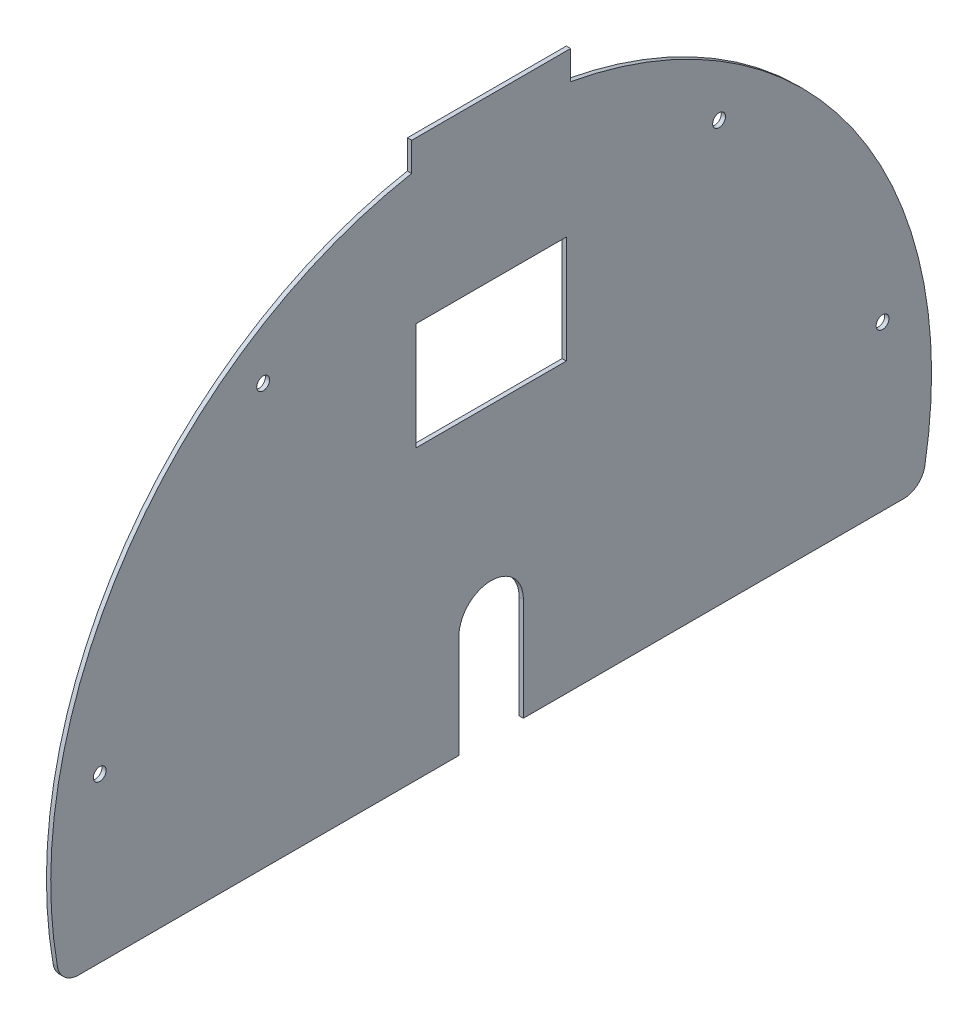
ISO-10303-21;
HEADER;
FILE_DESCRIPTION(('STEP AP214'),'2;1');
FILE_NAME('part.step','',(''),(''),'','','');
FILE_SCHEMA(('AUTOMOTIVE_DESIGN { 1 0 10303 214 1 1 1 1 }'));
ENDSEC;
DATA;
#1=APPLICATION_CONTEXT('core data for automotive mechanical design processes');
#2=APPLICATION_PROTOCOL_DEFINITION('international standard','automotive_design',2000,#1);
#3=PRODUCT_CONTEXT('',#1,'mechanical');
#4=PRODUCT('Part','Part','',(#3));
#5=PRODUCT_RELATED_PRODUCT_CATEGORY('part','',(#4));
#6=PRODUCT_DEFINITION_FORMATION('','',#4);
#7=PRODUCT_DEFINITION_CONTEXT('part definition',#1,'design');
#8=PRODUCT_DEFINITION('design','',#6,#7);
#9=PRODUCT_DEFINITION_SHAPE('','',#8);
#10=(LENGTH_UNIT() NAMED_UNIT(*) SI_UNIT(.MILLI.,.METRE.));
#11=(NAMED_UNIT(*) PLANE_ANGLE_UNIT() SI_UNIT($,.RADIAN.));
#12=(NAMED_UNIT(*) SI_UNIT($,.STERADIAN.) SOLID_ANGLE_UNIT());
#13=UNCERTAINTY_MEASURE_WITH_UNIT(LENGTH_MEASURE(1.E-05),#10,'distance_accuracy_value','');
#14=(GEOMETRIC_REPRESENTATION_CONTEXT(3) GLOBAL_UNCERTAINTY_ASSIGNED_CONTEXT((#13)) GLOBAL_UNIT_ASSIGNED_CONTEXT((#10,
#11,#12)) REPRESENTATION_CONTEXT('',''));
#15=CARTESIAN_POINT('',(0.,0.,0.));
#16=DIRECTION('',(0.,0.,1.));
#17=DIRECTION('',(1.,0.,0.));
#18=AXIS2_PLACEMENT_3D('',#15,#16,#17);
#19=CARTESIAN_POINT('',(-2.,48.,15.));
#20=DIRECTION('',(0.,0.,-1.));
#21=DIRECTION('',(-1.,0.,0.));
#22=AXIS2_PLACEMENT_3D('',#19,#20,#21);
#23=PLANE('',#22);
#24=DIRECTION('',(0.,1.,0.));
#25=VECTOR('',#24,1.);
#26=CARTESIAN_POINT('',(0.,48.,15.));
#27=LINE('',#26,#25);
#28=CARTESIAN_POINT('',(0.,0.,15.));
#29=VERTEX_POINT('',#28);
#30=CARTESIAN_POINT('',(0.,48.,15.));
#31=VERTEX_POINT('',#30);
#32=EDGE_CURVE('E192',#29,#31,#27,.T.);
#33=ORIENTED_EDGE('',*,*,#32,.F.);
#34=DIRECTION('',(1.,0.,0.));
#35=VECTOR('',#34,1.);
#36=CARTESIAN_POINT('',(-2.,0.,15.));
#37=LINE('',#36,#35);
#38=CARTESIAN_POINT('',(-2.,0.,15.));
#39=VERTEX_POINT('',#38);
#40=EDGE_CURVE('E251',#39,#29,#37,.T.);
#41=ORIENTED_EDGE('',*,*,#40,.F.);
#42=DIRECTION('',(0.,1.,0.));
#43=VECTOR('',#42,1.);
#44=CARTESIAN_POINT('',(-2.,48.,15.));
#45=LINE('',#44,#43);
#46=CARTESIAN_POINT('',(-2.,48.,15.));
#47=VERTEX_POINT('',#46);
#48=EDGE_CURVE('E196',#39,#47,#45,.T.);
#49=ORIENTED_EDGE('',*,*,#48,.T.);
#50=DIRECTION('',(1.,0.,0.));
#51=VECTOR('',#50,1.);
#52=CARTESIAN_POINT('',(-2.,48.,15.));
#53=LINE('',#52,#51);
#54=EDGE_CURVE('E224',#47,#31,#53,.T.);
#55=ORIENTED_EDGE('',*,*,#54,.T.);
#56=EDGE_LOOP('',(#33,#41,#49,#55));
#57=FACE_BOUND('',#56,.T.);
#58=ADVANCED_FACE('F36',(#57),#23,.T.);
#59=CARTESIAN_POINT('',(-2.,0.,15.));
#60=DIRECTION('',(0.,-1.,0.));
#61=DIRECTION('',(0.,0.,-1.));
#62=AXIS2_PLACEMENT_3D('',#59,#60,#61);
#63=PLANE('',#62);
#64=DIRECTION('',(0.,0.,-1.));
#65=VECTOR('',#64,1.);
#66=CARTESIAN_POINT('',(0.,0.,15.));
#67=LINE('',#66,#65);
#68=CARTESIAN_POINT('',(0.,0.,192.013020391847));
#69=VERTEX_POINT('',#68);
#70=EDGE_CURVE('E200',#69,#29,#67,.T.);
#71=ORIENTED_EDGE('',*,*,#70,.F.);
#72=DIRECTION('',(1.,0.,0.));
#73=VECTOR('',#72,1.);
#74=CARTESIAN_POINT('',(-2.,0.,192.013020391847));
#75=LINE('',#74,#73);
#76=CARTESIAN_POINT('',(-2.,0.,192.013020391847));
#77=VERTEX_POINT('',#76);
#78=EDGE_CURVE('E275',#69,#77,#75,.F.);
#79=ORIENTED_EDGE('',*,*,#78,.T.);
#80=DIRECTION('',(0.,0.,-1.));
#81=VECTOR('',#80,1.);
#82=CARTESIAN_POINT('',(-2.,0.,15.));
#83=LINE('',#82,#81);
#84=EDGE_CURVE('E222',#77,#39,#83,.T.);
#85=ORIENTED_EDGE('',*,*,#84,.T.);
#86=ORIENTED_EDGE('',*,*,#40,.T.);
#87=EDGE_LOOP('',(#71,#79,#85,#86));
#88=FACE_BOUND('',#87,.T.);
#89=ADVANCED_FACE('F330',(#88),#63,.T.);
#90=CARTESIAN_POINT('',(-2.,44.,0.));
#91=DIRECTION('',(1.,0.,0.));
#92=DIRECTION('',(0.,0.,-1.));
#93=AXIS2_PLACEMENT_3D('',#90,#91,#92);
#94=CYLINDRICAL_SURFACE('',#93,205.);
#95=CARTESIAN_POINT('',(-2.,44.,0.));
#96=DIRECTION('',(1.,0.,0.));
#97=DIRECTION('',(0.,0.,1.));
#98=AXIS2_PLACEMENT_3D('',#95,#96,#97);
#99=CIRCLE('',#98,205.);
#100=CARTESIAN_POINT('',(-2.,245.633330578057,36.9999999999999));
#101=VERTEX_POINT('',#100);
#102=CARTESIAN_POINT('',(-2.,8.25641025641027,201.859841950404));
#103=VERTEX_POINT('',#102);
#104=EDGE_CURVE('E219',#101,#103,#99,.T.);
#105=ORIENTED_EDGE('',*,*,#104,.T.);
#106=DIRECTION('',(1.,0.,0.));
#107=VECTOR('',#106,1.);
#108=CARTESIAN_POINT('',(-2.,8.25641025641026,201.859841950404));
#109=LINE('',#108,#107);
#110=CARTESIAN_POINT('',(0.,8.25641025641027,201.859841950404));
#111=VERTEX_POINT('',#110);
#112=EDGE_CURVE('E254',#103,#111,#109,.T.);
#113=ORIENTED_EDGE('',*,*,#112,.T.);
#114=CARTESIAN_POINT('',(0.,44.,0.));
#115=DIRECTION('',(1.,0.,0.));
#116=DIRECTION('',(0.,0.,1.));
#117=AXIS2_PLACEMENT_3D('',#114,#115,#116);
#118=CIRCLE('',#117,205.);
#119=CARTESIAN_POINT('',(0.,245.633330578057,36.9999999999999));
#120=VERTEX_POINT('',#119);
#121=EDGE_CURVE('E247',#120,#111,#118,.T.);
#122=ORIENTED_EDGE('',*,*,#121,.F.);
#123=DIRECTION('',(1.,0.,0.));
#124=VECTOR('',#123,1.);
#125=CARTESIAN_POINT('',(-2.,245.633330578057,36.9999999999999));
#126=LINE('',#125,#124);
#127=EDGE_CURVE('E255',#101,#120,#126,.T.);
#128=ORIENTED_EDGE('',*,*,#127,.F.);
#129=EDGE_LOOP('',(#105,#113,#122,#128));
#130=FACE_BOUND('',#129,.T.);
#131=ADVANCED_FACE('F309',(#130),#94,.T.);
#132=CARTESIAN_POINT('',(-2.,245.633330578057,37.));
#133=DIRECTION('',(0.,0.,1.));
#134=DIRECTION('',(1.,0.,0.));
#135=AXIS2_PLACEMENT_3D('',#132,#133,#134);
#136=PLANE('',#135);
#137=DIRECTION('',(0.,-1.,0.));
#138=VECTOR('',#137,1.);
#139=CARTESIAN_POINT('',(0.,245.633330578057,37.));
#140=LINE('',#139,#138);
#141=CARTESIAN_POINT('',(0.,259.,37.));
#142=VERTEX_POINT('',#141);
#143=EDGE_CURVE('E244',#142,#120,#140,.T.);
#144=ORIENTED_EDGE('',*,*,#143,.F.);
#145=DIRECTION('',(1.,0.,0.));
#146=VECTOR('',#145,1.);
#147=CARTESIAN_POINT('',(-2.,259.,37.));
#148=LINE('',#147,#146);
#149=CARTESIAN_POINT('',(-2.,259.,37.));
#150=VERTEX_POINT('',#149);
#151=EDGE_CURVE('E257',#150,#142,#148,.T.);
#152=ORIENTED_EDGE('',*,*,#151,.F.);
#153=DIRECTION('',(0.,-1.,0.));
#154=VECTOR('',#153,1.);
#155=CARTESIAN_POINT('',(-2.,245.633330578057,37.));
#156=LINE('',#155,#154);
#157=EDGE_CURVE('E216',#150,#101,#156,.T.);
#158=ORIENTED_EDGE('',*,*,#157,.T.);
#159=ORIENTED_EDGE('',*,*,#127,.T.);
#160=EDGE_LOOP('',(#144,#152,#158,#159));
#161=FACE_BOUND('',#160,.T.);
#162=ADVANCED_FACE('F314',(#161),#136,.T.);
#163=CARTESIAN_POINT('',(-2.,259.,37.));
#164=DIRECTION('',(0.,1.,0.));
#165=DIRECTION('',(0.,0.,1.));
#166=AXIS2_PLACEMENT_3D('',#163,#164,#165);
#167=PLANE('',#166);
#168=DIRECTION('',(0.,0.,1.));
#169=VECTOR('',#168,1.);
#170=CARTESIAN_POINT('',(0.,259.,37.));
#171=LINE('',#170,#169);
#172=CARTESIAN_POINT('',(0.,259.,-37.));
#173=VERTEX_POINT('',#172);
#174=EDGE_CURVE('E241',#173,#142,#171,.T.);
#175=ORIENTED_EDGE('',*,*,#174,.F.);
#176=DIRECTION('',(1.,0.,0.));
#177=VECTOR('',#176,1.);
#178=CARTESIAN_POINT('',(-2.,259.,-37.));
#179=LINE('',#178,#177);
#180=CARTESIAN_POINT('',(-2.,259.,-37.));
#181=VERTEX_POINT('',#180);
#182=EDGE_CURVE('E259',#181,#173,#179,.T.);
#183=ORIENTED_EDGE('',*,*,#182,.F.);
#184=DIRECTION('',(0.,0.,1.));
#185=VECTOR('',#184,1.);
#186=CARTESIAN_POINT('',(-2.,259.,37.));
#187=LINE('',#186,#185);
#188=EDGE_CURVE('E213',#181,#150,#187,.T.);
#189=ORIENTED_EDGE('',*,*,#188,.T.);
#190=ORIENTED_EDGE('',*,*,#151,.T.);
#191=EDGE_LOOP('',(#175,#183,#189,#190));
#192=FACE_BOUND('',#191,.T.);
#193=ADVANCED_FACE('F319',(#192),#167,.T.);
#194=CARTESIAN_POINT('',(-2.,259.,-37.));
#195=DIRECTION('',(0.,0.,-1.));
#196=DIRECTION('',(-1.,0.,0.));
#197=AXIS2_PLACEMENT_3D('',#194,#195,#196);
#198=PLANE('',#197);
#199=DIRECTION('',(0.,1.,0.));
#200=VECTOR('',#199,1.);
#201=CARTESIAN_POINT('',(0.,259.,-37.));
#202=LINE('',#201,#200);
#203=CARTESIAN_POINT('',(0.,245.633330578057,-37.));
#204=VERTEX_POINT('',#203);
#205=EDGE_CURVE('E238',#204,#173,#202,.T.);
#206=ORIENTED_EDGE('',*,*,#205,.F.);
#207=DIRECTION('',(1.,0.,0.));
#208=VECTOR('',#207,1.);
#209=CARTESIAN_POINT('',(-2.,245.633330578057,-37.));
#210=LINE('',#209,#208);
#211=CARTESIAN_POINT('',(-2.,245.633330578057,-37.));
#212=VERTEX_POINT('',#211);
#213=EDGE_CURVE('E261',#212,#204,#210,.T.);
#214=ORIENTED_EDGE('',*,*,#213,.F.);
#215=DIRECTION('',(0.,1.,0.));
#216=VECTOR('',#215,1.);
#217=CARTESIAN_POINT('',(-2.,259.,-37.));
#218=LINE('',#217,#216);
#219=EDGE_CURVE('E210',#212,#181,#218,.T.);
#220=ORIENTED_EDGE('',*,*,#219,.T.);
#221=ORIENTED_EDGE('',*,*,#182,.T.);
#222=EDGE_LOOP('',(#206,#214,#220,#221));
#223=FACE_BOUND('',#222,.T.);
#224=ADVANCED_FACE('F322',(#223),#198,.T.);
#225=CARTESIAN_POINT('',(-2.,44.,0.));
#226=DIRECTION('',(1.,0.,0.));
#227=DIRECTION('',(0.,0.,-1.));
#228=AXIS2_PLACEMENT_3D('',#225,#226,#227);
#229=CYLINDRICAL_SURFACE('',#228,205.);
#230=CARTESIAN_POINT('',(0.,44.,0.));
#231=DIRECTION('',(1.,0.,0.));
#232=DIRECTION('',(0.,0.,1.));
#233=AXIS2_PLACEMENT_3D('',#230,#231,#232);
#234=CIRCLE('',#233,205.);
#235=CARTESIAN_POINT('',(0.,8.25641025641025,-201.859841950404));
#236=VERTEX_POINT('',#235);
#237=EDGE_CURVE('E236',#236,#204,#234,.T.);
#238=ORIENTED_EDGE('',*,*,#237,.F.);
#239=DIRECTION('',(1.,0.,0.));
#240=VECTOR('',#239,1.);
#241=CARTESIAN_POINT('',(-2.,8.25641025641024,-201.859841950404));
#242=LINE('',#241,#240);
#243=CARTESIAN_POINT('',(-2.,8.25641025641025,-201.859841950404));
#244=VERTEX_POINT('',#243);
#245=EDGE_CURVE('E11',#236,#244,#242,.F.);
#246=ORIENTED_EDGE('',*,*,#245,.T.);
#247=CARTESIAN_POINT('',(-2.,44.,0.));
#248=DIRECTION('',(1.,0.,0.));
#249=DIRECTION('',(0.,0.,1.));
#250=AXIS2_PLACEMENT_3D('',#247,#248,#249);
#251=CIRCLE('',#250,205.);
#252=EDGE_CURVE('E208',#244,#212,#251,.T.);
#253=ORIENTED_EDGE('',*,*,#252,.T.);
#254=ORIENTED_EDGE('',*,*,#213,.T.);
#255=EDGE_LOOP('',(#238,#246,#253,#254));
#256=FACE_BOUND('',#255,.T.);
#257=ADVANCED_FACE('F343',(#256),#229,.T.);
#258=CARTESIAN_POINT('',(-2.,0.,-15.));
#259=DIRECTION('',(0.,-1.,0.));
#260=DIRECTION('',(0.,0.,-1.));
#261=AXIS2_PLACEMENT_3D('',#258,#259,#260);
#262=PLANE('',#261);
#263=DIRECTION('',(0.,0.,-1.));
#264=VECTOR('',#263,1.);
#265=CARTESIAN_POINT('',(-2.,0.,-15.));
#266=LINE('',#265,#264);
#267=CARTESIAN_POINT('',(-2.,0.,-15.));
#268=VERTEX_POINT('',#267);
#269=CARTESIAN_POINT('',(-2.,0.,-192.013020391847));
#270=VERTEX_POINT('',#269);
#271=EDGE_CURVE('E206',#268,#270,#266,.T.);
#272=ORIENTED_EDGE('',*,*,#271,.T.);
#273=DIRECTION('',(1.,0.,0.));
#274=VECTOR('',#273,1.);
#275=CARTESIAN_POINT('',(-2.,0.,-192.013020391847));
#276=LINE('',#275,#274);
#277=CARTESIAN_POINT('',(0.,0.,-192.013020391847));
#278=VERTEX_POINT('',#277);
#279=EDGE_CURVE('E44',#270,#278,#276,.T.);
#280=ORIENTED_EDGE('',*,*,#279,.T.);
#281=DIRECTION('',(0.,0.,-1.));
#282=VECTOR('',#281,1.);
#283=CARTESIAN_POINT('',(0.,0.,-15.));
#284=LINE('',#283,#282);
#285=CARTESIAN_POINT('',(0.,0.,-15.));
#286=VERTEX_POINT('',#285);
#287=EDGE_CURVE('E233',#286,#278,#284,.T.);
#288=ORIENTED_EDGE('',*,*,#287,.F.);
#289=DIRECTION('',(1.,0.,0.));
#290=VECTOR('',#289,1.);
#291=CARTESIAN_POINT('',(-2.,0.,-15.));
#292=LINE('',#291,#290);
#293=EDGE_CURVE('E264',#268,#286,#292,.T.);
#294=ORIENTED_EDGE('',*,*,#293,.F.);
#295=EDGE_LOOP('',(#272,#280,#288,#294));
#296=FACE_BOUND('',#295,.T.);
#297=ADVANCED_FACE('F283',(#296),#262,.T.);
#298=CARTESIAN_POINT('',(-2.,48.,-15.));
#299=DIRECTION('',(0.,0.,1.));
#300=DIRECTION('',(0.,-1.,0.));
#301=AXIS2_PLACEMENT_3D('',#298,#299,#300);
#302=PLANE('',#301);
#303=DIRECTION('',(0.,-1.,0.));
#304=VECTOR('',#303,1.);
#305=CARTESIAN_POINT('',(0.,48.,-15.));
#306=LINE('',#305,#304);
#307=CARTESIAN_POINT('',(0.,48.,-15.));
#308=VERTEX_POINT('',#307);
#309=EDGE_CURVE('E230',#308,#286,#306,.T.);
#310=ORIENTED_EDGE('',*,*,#309,.F.);
#311=DIRECTION('',(1.,0.,0.));
#312=VECTOR('',#311,1.);
#313=CARTESIAN_POINT('',(-2.,48.,-15.));
#314=LINE('',#313,#312);
#315=CARTESIAN_POINT('',(-2.,48.,-15.));
#316=VERTEX_POINT('',#315);
#317=EDGE_CURVE('E266',#316,#308,#314,.T.);
#318=ORIENTED_EDGE('',*,*,#317,.F.);
#319=DIRECTION('',(0.,-1.,0.));
#320=VECTOR('',#319,1.);
#321=CARTESIAN_POINT('',(-2.,48.,-15.));
#322=LINE('',#321,#320);
#323=EDGE_CURVE('E203',#316,#268,#322,.T.);
#324=ORIENTED_EDGE('',*,*,#323,.T.);
#325=ORIENTED_EDGE('',*,*,#293,.T.);
#326=EDGE_LOOP('',(#310,#318,#324,#325));
#327=FACE_BOUND('',#326,.T.);
#328=ADVANCED_FACE('F290',(#327),#302,.T.);
#329=CARTESIAN_POINT('',(-2.,48.,0.));
#330=DIRECTION('',(1.,0.,0.));
#331=DIRECTION('',(0.,0.,-1.));
#332=AXIS2_PLACEMENT_3D('',#329,#330,#331);
#333=CYLINDRICAL_SURFACE('',#332,15.);
#334=CARTESIAN_POINT('',(0.,48.,0.));
#335=DIRECTION('',(-1.,0.,0.));
#336=DIRECTION('',(0.,0.,1.));
#337=AXIS2_PLACEMENT_3D('',#334,#335,#336);
#338=CIRCLE('',#337,15.);
#339=EDGE_CURVE('E227',#31,#308,#338,.T.);
#340=ORIENTED_EDGE('',*,*,#339,.F.);
#341=ORIENTED_EDGE('',*,*,#54,.F.);
#342=CARTESIAN_POINT('',(-2.,48.,0.));
#343=DIRECTION('',(-1.,0.,0.));
#344=DIRECTION('',(0.,0.,1.));
#345=AXIS2_PLACEMENT_3D('',#342,#343,#344);
#346=CIRCLE('',#345,15.);
#347=EDGE_CURVE('E199',#47,#316,#346,.T.);
#348=ORIENTED_EDGE('',*,*,#347,.T.);
#349=ORIENTED_EDGE('',*,*,#317,.T.);
#350=EDGE_LOOP('',(#340,#341,#348,#349));
#351=FACE_BOUND('',#350,.T.);
#352=ADVANCED_FACE('F296',(#351),#333,.F.);
#353=CARTESIAN_POINT('',(-2.,44.,0.));
#354=DIRECTION('',(-1.,0.,0.));
#355=DIRECTION('',(0.,0.,1.));
#356=AXIS2_PLACEMENT_3D('',#353,#354,#355);
#357=PLANE('',#356);
#358=CARTESIAN_POINT('',(-2.,76.1249128683809,-182.189434307259));
#359=DIRECTION('',(-1.,0.,0.));
#360=DIRECTION('',(0.,0.,1.));
#361=AXIS2_PLACEMENT_3D('',#358,#359,#360);
#362=CIRCLE('',#361,2.99999999999999);
#363=CARTESIAN_POINT('',(-2.,76.1249128683809,-179.189434307259));
#364=VERTEX_POINT('',#363);
#365=EDGE_CURVE('E391',#364,#364,#362,.T.);
#366=ORIENTED_EDGE('',*,*,#365,.F.);
#367=EDGE_LOOP('',(#366));
#368=FACE_BOUND('',#367,.T.);
#369=CARTESIAN_POINT('',(-2.,195.543128193463,-106.111640724944));
#370=DIRECTION('',(-1.,0.,0.));
#371=DIRECTION('',(0.,0.,1.));
#372=AXIS2_PLACEMENT_3D('',#369,#370,#371);
#373=CIRCLE('',#372,3.00000000000001);
#374=CARTESIAN_POINT('',(-2.,195.543128193463,-103.111640724944));
#375=VERTEX_POINT('',#374);
#376=EDGE_CURVE('E395',#375,#375,#373,.T.);
#377=ORIENTED_EDGE('',*,*,#376,.F.);
#378=EDGE_LOOP('',(#377));
#379=FACE_BOUND('',#378,.T.);
#380=CARTESIAN_POINT('',(-2.,76.1249128683809,182.189434307259));
#381=DIRECTION('',(-1.,0.,0.));
#382=DIRECTION('',(0.,0.,1.));
#383=AXIS2_PLACEMENT_3D('',#380,#381,#382);
#384=CIRCLE('',#383,2.99999999999999);
#385=CARTESIAN_POINT('',(-2.,76.1249128683809,185.189434307259));
#386=VERTEX_POINT('',#385);
#387=EDGE_CURVE('E406',#386,#386,#384,.F.);
#388=ORIENTED_EDGE('',*,*,#387,.T.);
#389=EDGE_LOOP('',(#388));
#390=FACE_BOUND('',#389,.T.);
#391=CARTESIAN_POINT('',(-2.,195.543128193463,106.111640724944));
#392=DIRECTION('',(-1.,0.,0.));
#393=DIRECTION('',(0.,0.,1.));
#394=AXIS2_PLACEMENT_3D('',#391,#392,#393);
#395=CIRCLE('',#394,3.00000000000001);
#396=CARTESIAN_POINT('',(-2.,195.543128193463,109.111640724944));
#397=VERTEX_POINT('',#396);
#398=EDGE_CURVE('E179',#397,#397,#395,.F.);
#399=ORIENTED_EDGE('',*,*,#398,.T.);
#400=EDGE_LOOP('',(#399));
#401=FACE_BOUND('',#400,.T.);
#402=DIRECTION('',(0.,1.,0.));
#403=VECTOR('',#402,1.);
#404=CARTESIAN_POINT('',(-2.,134.,-35.));
#405=LINE('',#404,#403);
#406=CARTESIAN_POINT('',(-2.,134.,-35.));
#407=VERTEX_POINT('',#406);
#408=CARTESIAN_POINT('',(-2.,184.,-35.));
#409=VERTEX_POINT('',#408);
#410=EDGE_CURVE('E153',#407,#409,#405,.T.);
#411=ORIENTED_EDGE('',*,*,#410,.T.);
#412=DIRECTION('',(0.,0.,1.));
#413=VECTOR('',#412,1.);
#414=CARTESIAN_POINT('',(-2.,184.,35.));
#415=LINE('',#414,#413);
#416=CARTESIAN_POINT('',(-2.,184.,35.));
#417=VERTEX_POINT('',#416);
#418=EDGE_CURVE('E165',#409,#417,#415,.T.);
#419=ORIENTED_EDGE('',*,*,#418,.T.);
#420=DIRECTION('',(0.,-1.,0.));
#421=VECTOR('',#420,1.);
#422=CARTESIAN_POINT('',(-2.,134.,35.));
#423=LINE('',#422,#421);
#424=CARTESIAN_POINT('',(-2.,134.,35.));
#425=VERTEX_POINT('',#424);
#426=EDGE_CURVE('E169',#417,#425,#423,.T.);
#427=ORIENTED_EDGE('',*,*,#426,.T.);
#428=DIRECTION('',(0.,0.,-1.));
#429=VECTOR('',#428,1.);
#430=CARTESIAN_POINT('',(-2.,134.,35.));
#431=LINE('',#430,#429);
#432=EDGE_CURVE('E161',#425,#407,#431,.T.);
#433=ORIENTED_EDGE('',*,*,#432,.T.);
#434=EDGE_LOOP('',(#411,#419,#427,#433));
#435=FACE_BOUND('',#434,.T.);
#436=ORIENTED_EDGE('',*,*,#84,.F.);
#437=CARTESIAN_POINT('',(-2.,10.,192.013020391847));
#438=DIRECTION('',(-1.,0.,0.));
#439=DIRECTION('',(0.,0.,1.));
#440=AXIS2_PLACEMENT_3D('',#437,#438,#439);
#441=CIRCLE('',#440,10.);
#442=EDGE_CURVE('E278',#77,#103,#441,.T.);
#443=ORIENTED_EDGE('',*,*,#442,.T.);
#444=ORIENTED_EDGE('',*,*,#104,.F.);
#445=ORIENTED_EDGE('',*,*,#157,.F.);
#446=ORIENTED_EDGE('',*,*,#188,.F.);
#447=ORIENTED_EDGE('',*,*,#219,.F.);
#448=ORIENTED_EDGE('',*,*,#252,.F.);
#449=CARTESIAN_POINT('',(-2.,10.,-192.013020391847));
#450=DIRECTION('',(-1.,0.,0.));
#451=DIRECTION('',(0.,0.,1.));
#452=AXIS2_PLACEMENT_3D('',#449,#450,#451);
#453=CIRCLE('',#452,10.);
#454=EDGE_CURVE('E51',#244,#270,#453,.T.);
#455=ORIENTED_EDGE('',*,*,#454,.T.);
#456=ORIENTED_EDGE('',*,*,#271,.F.);
#457=ORIENTED_EDGE('',*,*,#323,.F.);
#458=ORIENTED_EDGE('',*,*,#347,.F.);
#459=ORIENTED_EDGE('',*,*,#48,.F.);
#460=EDGE_LOOP('',(#436,#443,#444,#445,#446,#447,#448,#455,#456,#457,#458,#459));
#461=FACE_BOUND('',#460,.T.);
#462=ADVANCED_FACE('F171',(#368,#379,#390,#401,#435,#461),#357,.T.);
#463=CARTESIAN_POINT('',(0.,44.,0.));
#464=DIRECTION('',(-1.,0.,0.));
#465=DIRECTION('',(0.,0.,1.));
#466=AXIS2_PLACEMENT_3D('',#463,#464,#465);
#467=PLANE('',#466);
#468=CARTESIAN_POINT('',(0.,76.1249128683809,-182.189434307259));
#469=DIRECTION('',(-1.,0.,0.));
#470=DIRECTION('',(0.,0.,1.));
#471=AXIS2_PLACEMENT_3D('',#468,#469,#470);
#472=CIRCLE('',#471,2.99999999999999);
#473=CARTESIAN_POINT('',(0.,76.1249128683809,-179.189434307259));
#474=VERTEX_POINT('',#473);
#475=EDGE_CURVE('E394',#474,#474,#472,.T.);
#476=ORIENTED_EDGE('',*,*,#475,.T.);
#477=EDGE_LOOP('',(#476));
#478=FACE_BOUND('',#477,.T.);
#479=CARTESIAN_POINT('',(0.,195.543128193463,-106.111640724944));
#480=DIRECTION('',(-1.,0.,0.));
#481=DIRECTION('',(0.,0.,1.));
#482=AXIS2_PLACEMENT_3D('',#479,#480,#481);
#483=CIRCLE('',#482,3.00000000000001);
#484=CARTESIAN_POINT('',(0.,195.543128193463,-103.111640724944));
#485=VERTEX_POINT('',#484);
#486=EDGE_CURVE('E399',#485,#485,#483,.T.);
#487=ORIENTED_EDGE('',*,*,#486,.T.);
#488=EDGE_LOOP('',(#487));
#489=FACE_BOUND('',#488,.T.);
#490=CARTESIAN_POINT('',(0.,76.1249128683809,182.189434307259));
#491=DIRECTION('',(1.,0.,0.));
#492=DIRECTION('',(0.,0.,-1.));
#493=AXIS2_PLACEMENT_3D('',#490,#491,#492);
#494=CIRCLE('',#493,2.99999999999999);
#495=CARTESIAN_POINT('',(0.,76.1249128683809,179.189434307259));
#496=VERTEX_POINT('',#495);
#497=EDGE_CURVE('E186',#496,#496,#494,.T.);
#498=ORIENTED_EDGE('',*,*,#497,.F.);
#499=EDGE_LOOP('',(#498));
#500=FACE_BOUND('',#499,.T.);
#501=CARTESIAN_POINT('',(0.,195.543128193463,106.111640724944));
#502=DIRECTION('',(1.,0.,0.));
#503=DIRECTION('',(0.,0.,-1.));
#504=AXIS2_PLACEMENT_3D('',#501,#502,#503);
#505=CIRCLE('',#504,3.00000000000001);
#506=CARTESIAN_POINT('',(0.,195.543128193463,103.111640724944));
#507=VERTEX_POINT('',#506);
#508=EDGE_CURVE('E408',#507,#507,#505,.T.);
#509=ORIENTED_EDGE('',*,*,#508,.F.);
#510=EDGE_LOOP('',(#509));
#511=FACE_BOUND('',#510,.T.);
#512=DIRECTION('',(0.,0.,1.));
#513=VECTOR('',#512,1.);
#514=CARTESIAN_POINT('',(0.,184.,35.));
#515=LINE('',#514,#513);
#516=CARTESIAN_POINT('',(0.,184.,-35.));
#517=VERTEX_POINT('',#516);
#518=CARTESIAN_POINT('',(0.,184.,35.));
#519=VERTEX_POINT('',#518);
#520=EDGE_CURVE('E185',#517,#519,#515,.T.);
#521=ORIENTED_EDGE('',*,*,#520,.F.);
#522=DIRECTION('',(0.,1.,0.));
#523=VECTOR('',#522,1.);
#524=CARTESIAN_POINT('',(0.,134.,-35.));
#525=LINE('',#524,#523);
#526=CARTESIAN_POINT('',(0.,134.,-35.));
#527=VERTEX_POINT('',#526);
#528=EDGE_CURVE('E156',#527,#517,#525,.T.);
#529=ORIENTED_EDGE('',*,*,#528,.F.);
#530=DIRECTION('',(0.,0.,-1.));
#531=VECTOR('',#530,1.);
#532=CARTESIAN_POINT('',(0.,134.,35.));
#533=LINE('',#532,#531);
#534=CARTESIAN_POINT('',(0.,134.,35.));
#535=VERTEX_POINT('',#534);
#536=EDGE_CURVE('E173',#535,#527,#533,.T.);
#537=ORIENTED_EDGE('',*,*,#536,.F.);
#538=DIRECTION('',(0.,-1.,0.));
#539=VECTOR('',#538,1.);
#540=CARTESIAN_POINT('',(0.,134.,35.));
#541=LINE('',#540,#539);
#542=EDGE_CURVE('E176',#519,#535,#541,.T.);
#543=ORIENTED_EDGE('',*,*,#542,.F.);
#544=EDGE_LOOP('',(#521,#529,#537,#543));
#545=FACE_BOUND('',#544,.T.);
#546=ORIENTED_EDGE('',*,*,#121,.T.);
#547=CARTESIAN_POINT('',(0.,10.,192.013020391847));
#548=DIRECTION('',(-1.,0.,0.));
#549=DIRECTION('',(0.,0.,1.));
#550=AXIS2_PLACEMENT_3D('',#547,#548,#549);
#551=CIRCLE('',#550,10.);
#552=EDGE_CURVE('E273',#111,#69,#551,.F.);
#553=ORIENTED_EDGE('',*,*,#552,.T.);
#554=ORIENTED_EDGE('',*,*,#70,.T.);
#555=ORIENTED_EDGE('',*,*,#32,.T.);
#556=ORIENTED_EDGE('',*,*,#339,.T.);
#557=ORIENTED_EDGE('',*,*,#309,.T.);
#558=ORIENTED_EDGE('',*,*,#287,.T.);
#559=CARTESIAN_POINT('',(0.,10.,-192.013020391847));
#560=DIRECTION('',(-1.,0.,0.));
#561=DIRECTION('',(0.,0.,1.));
#562=AXIS2_PLACEMENT_3D('',#559,#560,#561);
#563=CIRCLE('',#562,10.);
#564=EDGE_CURVE('E271',#278,#236,#563,.F.);
#565=ORIENTED_EDGE('',*,*,#564,.T.);
#566=ORIENTED_EDGE('',*,*,#237,.T.);
#567=ORIENTED_EDGE('',*,*,#205,.T.);
#568=ORIENTED_EDGE('',*,*,#174,.T.);
#569=ORIENTED_EDGE('',*,*,#143,.T.);
#570=EDGE_LOOP('',(#546,#553,#554,#555,#556,#557,#558,#565,#566,#567,#568,#569));
#571=FACE_BOUND('',#570,.T.);
#572=ADVANCED_FACE('F286',(#478,#489,#500,#511,#545,#571),#467,.F.);
#573=CARTESIAN_POINT('',(-2.,134.,-35.));
#574=DIRECTION('',(0.,0.,-1.));
#575=DIRECTION('',(-1.,0.,0.));
#576=AXIS2_PLACEMENT_3D('',#573,#574,#575);
#577=PLANE('',#576);
#578=ORIENTED_EDGE('',*,*,#528,.T.);
#579=DIRECTION('',(1.,0.,0.));
#580=VECTOR('',#579,1.);
#581=CARTESIAN_POINT('',(-2.,184.,-35.));
#582=LINE('',#581,#580);
#583=EDGE_CURVE('E149',#409,#517,#582,.T.);
#584=ORIENTED_EDGE('',*,*,#583,.F.);
#585=ORIENTED_EDGE('',*,*,#410,.F.);
#586=DIRECTION('',(1.,0.,0.));
#587=VECTOR('',#586,1.);
#588=CARTESIAN_POINT('',(-2.,134.,-35.));
#589=LINE('',#588,#587);
#590=EDGE_CURVE('E190',#407,#527,#589,.T.);
#591=ORIENTED_EDGE('',*,*,#590,.T.);
#592=EDGE_LOOP('',(#578,#584,#585,#591));
#593=FACE_BOUND('',#592,.T.);
#594=ADVANCED_FACE('F151',(#593),#577,.F.);
#595=CARTESIAN_POINT('',(-2.,134.,35.));
#596=DIRECTION('',(0.,-1.,0.));
#597=DIRECTION('',(0.,0.,-1.));
#598=AXIS2_PLACEMENT_3D('',#595,#596,#597);
#599=PLANE('',#598);
#600=ORIENTED_EDGE('',*,*,#536,.T.);
#601=ORIENTED_EDGE('',*,*,#590,.F.);
#602=ORIENTED_EDGE('',*,*,#432,.F.);
#603=DIRECTION('',(1.,0.,0.));
#604=VECTOR('',#603,1.);
#605=CARTESIAN_POINT('',(-2.,134.,35.));
#606=LINE('',#605,#604);
#607=EDGE_CURVE('E193',#425,#535,#606,.T.);
#608=ORIENTED_EDGE('',*,*,#607,.T.);
#609=EDGE_LOOP('',(#600,#601,#602,#608));
#610=FACE_BOUND('',#609,.T.);
#611=ADVANCED_FACE('F362',(#610),#599,.F.);
#612=CARTESIAN_POINT('',(-2.,134.,35.));
#613=DIRECTION('',(0.,0.,1.));
#614=DIRECTION('',(1.,0.,0.));
#615=AXIS2_PLACEMENT_3D('',#612,#613,#614);
#616=PLANE('',#615);
#617=ORIENTED_EDGE('',*,*,#542,.T.);
#618=ORIENTED_EDGE('',*,*,#607,.F.);
#619=ORIENTED_EDGE('',*,*,#426,.F.);
#620=DIRECTION('',(1.,0.,0.));
#621=VECTOR('',#620,1.);
#622=CARTESIAN_POINT('',(-2.,184.,35.));
#623=LINE('',#622,#621);
#624=EDGE_CURVE('E160',#417,#519,#623,.T.);
#625=ORIENTED_EDGE('',*,*,#624,.T.);
#626=EDGE_LOOP('',(#617,#618,#619,#625));
#627=FACE_BOUND('',#626,.T.);
#628=ADVANCED_FACE('F366',(#627),#616,.F.);
#629=CARTESIAN_POINT('',(-2.,184.,35.));
#630=DIRECTION('',(0.,1.,0.));
#631=DIRECTION('',(0.,0.,1.));
#632=AXIS2_PLACEMENT_3D('',#629,#630,#631);
#633=PLANE('',#632);
#634=ORIENTED_EDGE('',*,*,#520,.T.);
#635=ORIENTED_EDGE('',*,*,#624,.F.);
#636=ORIENTED_EDGE('',*,*,#418,.F.);
#637=ORIENTED_EDGE('',*,*,#583,.T.);
#638=EDGE_LOOP('',(#634,#635,#636,#637));
#639=FACE_BOUND('',#638,.T.);
#640=ADVANCED_FACE('F166',(#639),#633,.F.);
#641=CARTESIAN_POINT('',(-2.001,195.543128193463,106.111640724944));
#642=DIRECTION('',(1.,0.,0.));
#643=DIRECTION('',(0.,0.,-1.));
#644=AXIS2_PLACEMENT_3D('',#641,#642,#643);
#645=CYLINDRICAL_SURFACE('',#644,3.00000000000001);
#646=ORIENTED_EDGE('',*,*,#398,.F.);
#647=EDGE_LOOP('',(#646));
#648=FACE_BOUND('',#647,.T.);
#649=ORIENTED_EDGE('',*,*,#508,.T.);
#650=EDGE_LOOP('',(#649));
#651=FACE_BOUND('',#650,.T.);
#652=ADVANCED_FACE('F365',(#648,#651),#645,.F.);
#653=CARTESIAN_POINT('',(-2.001,76.1249128683809,182.189434307259));
#654=DIRECTION('',(1.,0.,0.));
#655=DIRECTION('',(0.,0.,-1.));
#656=AXIS2_PLACEMENT_3D('',#653,#654,#655);
#657=CYLINDRICAL_SURFACE('',#656,2.99999999999999);
#658=ORIENTED_EDGE('',*,*,#387,.F.);
#659=EDGE_LOOP('',(#658));
#660=FACE_BOUND('',#659,.T.);
#661=ORIENTED_EDGE('',*,*,#497,.T.);
#662=EDGE_LOOP('',(#661));
#663=FACE_BOUND('',#662,.T.);
#664=ADVANCED_FACE('F375',(#660,#663),#657,.F.);
#665=CARTESIAN_POINT('',(-2.001,195.543128193463,-106.111640724944));
#666=DIRECTION('',(1.,0.,0.));
#667=DIRECTION('',(0.,0.,-1.));
#668=AXIS2_PLACEMENT_3D('',#665,#666,#667);
#669=CYLINDRICAL_SURFACE('',#668,3.00000000000001);
#670=ORIENTED_EDGE('',*,*,#376,.T.);
#671=EDGE_LOOP('',(#670));
#672=FACE_BOUND('',#671,.T.);
#673=ORIENTED_EDGE('',*,*,#486,.F.);
#674=EDGE_LOOP('',(#673));
#675=FACE_BOUND('',#674,.T.);
#676=ADVANCED_FACE('F379',(#672,#675),#669,.F.);
#677=CARTESIAN_POINT('',(-2.001,76.1249128683809,-182.189434307259));
#678=DIRECTION('',(1.,0.,0.));
#679=DIRECTION('',(0.,0.,-1.));
#680=AXIS2_PLACEMENT_3D('',#677,#678,#679);
#681=CYLINDRICAL_SURFACE('',#680,2.99999999999999);
#682=ORIENTED_EDGE('',*,*,#365,.T.);
#683=EDGE_LOOP('',(#682));
#684=FACE_BOUND('',#683,.T.);
#685=ORIENTED_EDGE('',*,*,#475,.F.);
#686=EDGE_LOOP('',(#685));
#687=FACE_BOUND('',#686,.T.);
#688=ADVANCED_FACE('F328',(#684,#687),#681,.F.);
#689=CARTESIAN_POINT('',(-2.,10.,192.013020391847));
#690=DIRECTION('',(1.,0.,0.));
#691=DIRECTION('',(0.,0.,-1.));
#692=AXIS2_PLACEMENT_3D('',#689,#690,#691);
#693=CYLINDRICAL_SURFACE('',#692,10.);
#694=ORIENTED_EDGE('',*,*,#442,.F.);
#695=ORIENTED_EDGE('',*,*,#78,.F.);
#696=ORIENTED_EDGE('',*,*,#552,.F.);
#697=ORIENTED_EDGE('',*,*,#112,.F.);
#698=EDGE_LOOP('',(#694,#695,#696,#697));
#699=FACE_BOUND('',#698,.T.);
#700=ADVANCED_FACE('F306',(#699),#693,.T.);
#701=CARTESIAN_POINT('',(-2.,10.,-192.013020391847));
#702=DIRECTION('',(1.,0.,0.));
#703=DIRECTION('',(0.,0.,-1.));
#704=AXIS2_PLACEMENT_3D('',#701,#702,#703);
#705=CYLINDRICAL_SURFACE('',#704,10.);
#706=ORIENTED_EDGE('',*,*,#454,.F.);
#707=ORIENTED_EDGE('',*,*,#245,.F.);
#708=ORIENTED_EDGE('',*,*,#564,.F.);
#709=ORIENTED_EDGE('',*,*,#279,.F.);
#710=EDGE_LOOP('',(#706,#707,#708,#709));
#711=FACE_BOUND('',#710,.T.);
#712=ADVANCED_FACE('F38',(#711),#705,.T.);
#713=CLOSED_SHELL('',(#58,#89,#131,#162,#193,#224,#257,#297,#328,#352,#462,#572,#594,#611,#628,
#640,#652,#664,#676,#688,#700,#712));
#714=MANIFOLD_SOLID_BREP('B2',#713);
#715=ADVANCED_BREP_SHAPE_REPRESENTATION('',(#18,#714),#14);
#716=SHAPE_DEFINITION_REPRESENTATION(#9,#715);
ENDSEC;
END-ISO-10303-21;
